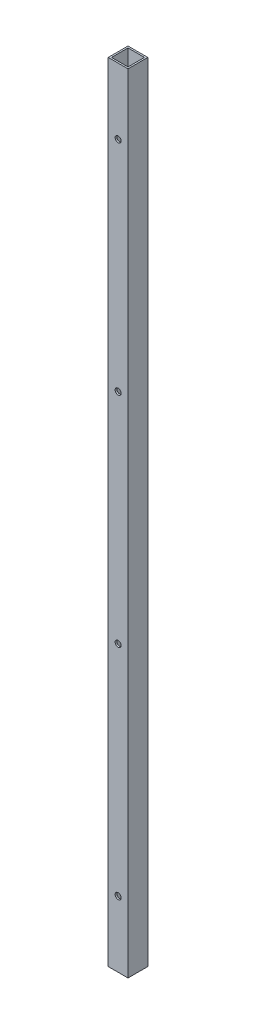
ISO-10303-21;
HEADER;
FILE_DESCRIPTION(('STEP AP214'),'2;1');
FILE_NAME('part.step','',(''),(''),'','','');
FILE_SCHEMA(('AUTOMOTIVE_DESIGN { 1 0 10303 214 1 1 1 1 }'));
ENDSEC;
DATA;
#1=APPLICATION_CONTEXT('core data for automotive mechanical design processes');
#2=APPLICATION_PROTOCOL_DEFINITION('international standard','automotive_design',2000,#1);
#3=PRODUCT_CONTEXT('',#1,'mechanical');
#4=PRODUCT('Part','Part','',(#3));
#5=PRODUCT_RELATED_PRODUCT_CATEGORY('part','',(#4));
#6=PRODUCT_DEFINITION_FORMATION('','',#4);
#7=PRODUCT_DEFINITION_CONTEXT('part definition',#1,'design');
#8=PRODUCT_DEFINITION('design','',#6,#7);
#9=PRODUCT_DEFINITION_SHAPE('','',#8);
#10=(LENGTH_UNIT() NAMED_UNIT(*) SI_UNIT(.MILLI.,.METRE.));
#11=(NAMED_UNIT(*) PLANE_ANGLE_UNIT() SI_UNIT($,.RADIAN.));
#12=(NAMED_UNIT(*) SI_UNIT($,.STERADIAN.) SOLID_ANGLE_UNIT());
#13=UNCERTAINTY_MEASURE_WITH_UNIT(LENGTH_MEASURE(1.E-05),#10,'distance_accuracy_value','');
#14=(GEOMETRIC_REPRESENTATION_CONTEXT(3) GLOBAL_UNCERTAINTY_ASSIGNED_CONTEXT((#13)) GLOBAL_UNIT_ASSIGNED_CONTEXT((#10,
#11,#12)) REPRESENTATION_CONTEXT('',''));
#15=CARTESIAN_POINT('',(0.,0.,0.));
#16=DIRECTION('',(0.,0.,1.));
#17=DIRECTION('',(1.,0.,0.));
#18=AXIS2_PLACEMENT_3D('',#15,#16,#17);
#19=CARTESIAN_POINT('',(0.,63.6015999999999,-9.525));
#20=DIRECTION('',(0.,0.,1.));
#21=DIRECTION('',(1.,0.,0.));
#22=AXIS2_PLACEMENT_3D('',#19,#20,#21);
#23=CYLINDRICAL_SURFACE('',#22,2.89559999999993);
#24=CARTESIAN_POINT('',(0.,63.6015999999999,7.93749999999999));
#25=DIRECTION('',(0.,0.,-1.));
#26=DIRECTION('',(-1.,0.,0.));
#27=AXIS2_PLACEMENT_3D('',#24,#25,#26);
#28=CIRCLE('',#27,2.89559999999993);
#29=CARTESIAN_POINT('',(-2.89559999999993,63.6015999999999,7.93749999999999));
#30=VERTEX_POINT('',#29);
#31=EDGE_CURVE('E39',#30,#30,#28,.T.);
#32=ORIENTED_EDGE('',*,*,#31,.T.);
#33=EDGE_LOOP('',(#32));
#34=FACE_BOUND('',#33,.T.);
#35=CARTESIAN_POINT('',(0.,63.6015999999999,9.525));
#36=DIRECTION('',(0.,0.,1.));
#37=DIRECTION('',(1.,0.,0.));
#38=AXIS2_PLACEMENT_3D('',#35,#36,#37);
#39=CIRCLE('',#38,2.89559999999993);
#40=CARTESIAN_POINT('',(2.89559999999993,63.6015999999999,9.525));
#41=VERTEX_POINT('',#40);
#42=EDGE_CURVE('E11',#41,#41,#39,.T.);
#43=ORIENTED_EDGE('',*,*,#42,.T.);
#44=EDGE_LOOP('',(#43));
#45=FACE_BOUND('',#44,.T.);
#46=ADVANCED_FACE('F32',(#34,#45),#23,.F.);
#47=CARTESIAN_POINT('',(0.,274.176066666667,-9.525));
#48=DIRECTION('',(0.,0.,1.));
#49=DIRECTION('',(1.,0.,0.));
#50=AXIS2_PLACEMENT_3D('',#47,#48,#49);
#51=CYLINDRICAL_SURFACE('',#50,2.89559999999993);
#52=CARTESIAN_POINT('',(0.,274.176066666667,7.93749999999999));
#53=DIRECTION('',(0.,0.,-1.));
#54=DIRECTION('',(-1.,0.,0.));
#55=AXIS2_PLACEMENT_3D('',#52,#53,#54);
#56=CIRCLE('',#55,2.89559999999993);
#57=CARTESIAN_POINT('',(-2.89559999999993,274.176066666667,7.93749999999999));
#58=VERTEX_POINT('',#57);
#59=EDGE_CURVE('E181',#58,#58,#56,.T.);
#60=ORIENTED_EDGE('',*,*,#59,.T.);
#61=EDGE_LOOP('',(#60));
#62=FACE_BOUND('',#61,.T.);
#63=CARTESIAN_POINT('',(0.,274.176066666667,9.525));
#64=DIRECTION('',(0.,0.,1.));
#65=DIRECTION('',(1.,0.,0.));
#66=AXIS2_PLACEMENT_3D('',#63,#64,#65);
#67=CIRCLE('',#66,2.89559999999993);
#68=CARTESIAN_POINT('',(2.89559999999993,274.176066666667,9.525));
#69=VERTEX_POINT('',#68);
#70=EDGE_CURVE('E184',#69,#69,#67,.T.);
#71=ORIENTED_EDGE('',*,*,#70,.T.);
#72=EDGE_LOOP('',(#71));
#73=FACE_BOUND('',#72,.T.);
#74=ADVANCED_FACE('F209',(#62,#73),#51,.F.);
#75=CARTESIAN_POINT('',(0.,63.6015999999999,-9.525));
#76=DIRECTION('',(0.,0.,1.));
#77=DIRECTION('',(1.,0.,0.));
#78=AXIS2_PLACEMENT_3D('',#75,#76,#77);
#79=CYLINDRICAL_SURFACE('',#78,2.89559999999993);
#80=CARTESIAN_POINT('',(0.,63.6015999999999,-7.9375));
#81=DIRECTION('',(0.,0.,1.));
#82=DIRECTION('',(1.,0.,0.));
#83=AXIS2_PLACEMENT_3D('',#80,#81,#82);
#84=CIRCLE('',#83,2.89559999999993);
#85=CARTESIAN_POINT('',(2.89559999999993,63.6015999999999,-7.9375));
#86=VERTEX_POINT('',#85);
#87=EDGE_CURVE('E175',#86,#86,#84,.T.);
#88=ORIENTED_EDGE('',*,*,#87,.T.);
#89=EDGE_LOOP('',(#88));
#90=FACE_BOUND('',#89,.T.);
#91=CARTESIAN_POINT('',(0.,63.6015999999999,-9.525));
#92=DIRECTION('',(0.,0.,1.));
#93=DIRECTION('',(1.,0.,0.));
#94=AXIS2_PLACEMENT_3D('',#91,#92,#93);
#95=CIRCLE('',#94,2.89559999999993);
#96=CARTESIAN_POINT('',(2.89559999999993,63.6015999999999,-9.525));
#97=VERTEX_POINT('',#96);
#98=EDGE_CURVE('E178',#97,#97,#95,.T.);
#99=ORIENTED_EDGE('',*,*,#98,.F.);
#100=EDGE_LOOP('',(#99));
#101=FACE_BOUND('',#100,.T.);
#102=ADVANCED_FACE('F213',(#90,#101),#79,.F.);
#103=CARTESIAN_POINT('',(0.,274.176066666667,-9.525));
#104=DIRECTION('',(0.,0.,1.));
#105=DIRECTION('',(1.,0.,0.));
#106=AXIS2_PLACEMENT_3D('',#103,#104,#105);
#107=CYLINDRICAL_SURFACE('',#106,2.89559999999993);
#108=CARTESIAN_POINT('',(0.,274.176066666667,-7.9375));
#109=DIRECTION('',(0.,0.,1.));
#110=DIRECTION('',(1.,0.,0.));
#111=AXIS2_PLACEMENT_3D('',#108,#109,#110);
#112=CIRCLE('',#111,2.89559999999993);
#113=CARTESIAN_POINT('',(2.89559999999993,274.176066666667,-7.9375));
#114=VERTEX_POINT('',#113);
#115=EDGE_CURVE('E165',#114,#114,#112,.T.);
#116=ORIENTED_EDGE('',*,*,#115,.T.);
#117=EDGE_LOOP('',(#116));
#118=FACE_BOUND('',#117,.T.);
#119=CARTESIAN_POINT('',(0.,274.176066666667,-9.525));
#120=DIRECTION('',(0.,0.,1.));
#121=DIRECTION('',(1.,0.,0.));
#122=AXIS2_PLACEMENT_3D('',#119,#120,#121);
#123=CIRCLE('',#122,2.89559999999993);
#124=CARTESIAN_POINT('',(2.89559999999993,274.176066666667,-9.525));
#125=VERTEX_POINT('',#124);
#126=EDGE_CURVE('E172',#125,#125,#123,.T.);
#127=ORIENTED_EDGE('',*,*,#126,.F.);
#128=EDGE_LOOP('',(#127));
#129=FACE_BOUND('',#128,.T.);
#130=ADVANCED_FACE('F218',(#118,#129),#107,.F.);
#131=CARTESIAN_POINT('',(0.,758.9266,0.));
#132=DIRECTION('',(0.,1.,0.));
#133=DIRECTION('',(0.,0.,1.));
#134=AXIS2_PLACEMENT_3D('',#131,#132,#133);
#135=PLANE('',#134);
#136=DIRECTION('',(0.,0.,-1.));
#137=VECTOR('',#136,1.);
#138=CARTESIAN_POINT('',(9.525,758.9266,-9.525));
#139=LINE('',#138,#137);
#140=CARTESIAN_POINT('',(9.525,758.9266,9.525));
#141=VERTEX_POINT('',#140);
#142=CARTESIAN_POINT('',(9.525,758.9266,-9.525));
#143=VERTEX_POINT('',#142);
#144=EDGE_CURVE('E136',#141,#143,#139,.T.);
#145=ORIENTED_EDGE('',*,*,#144,.T.);
#146=DIRECTION('',(-1.,0.,0.));
#147=VECTOR('',#146,1.);
#148=CARTESIAN_POINT('',(-9.525,758.9266,-9.525));
#149=LINE('',#148,#147);
#150=CARTESIAN_POINT('',(-9.525,758.9266,-9.525));
#151=VERTEX_POINT('',#150);
#152=EDGE_CURVE('E139',#143,#151,#149,.T.);
#153=ORIENTED_EDGE('',*,*,#152,.T.);
#154=DIRECTION('',(0.,0.,1.));
#155=VECTOR('',#154,1.);
#156=CARTESIAN_POINT('',(-9.525,758.9266,-9.525));
#157=LINE('',#156,#155);
#158=CARTESIAN_POINT('',(-9.525,758.9266,9.525));
#159=VERTEX_POINT('',#158);
#160=EDGE_CURVE('E142',#151,#159,#157,.T.);
#161=ORIENTED_EDGE('',*,*,#160,.T.);
#162=DIRECTION('',(1.,0.,0.));
#163=VECTOR('',#162,1.);
#164=CARTESIAN_POINT('',(-9.525,758.9266,9.525));
#165=LINE('',#164,#163);
#166=EDGE_CURVE('E144',#159,#141,#165,.T.);
#167=ORIENTED_EDGE('',*,*,#166,.T.);
#168=EDGE_LOOP('',(#145,#153,#161,#167));
#169=FACE_BOUND('',#168,.T.);
#170=DIRECTION('',(-1.,0.,0.));
#171=VECTOR('',#170,1.);
#172=CARTESIAN_POINT('',(-7.9375,758.9266,-7.9375));
#173=LINE('',#172,#171);
#174=CARTESIAN_POINT('',(7.9375,758.9266,-7.9375));
#175=VERTEX_POINT('',#174);
#176=CARTESIAN_POINT('',(-7.9375,758.9266,-7.9375));
#177=VERTEX_POINT('',#176);
#178=EDGE_CURVE('E104',#175,#177,#173,.T.);
#179=ORIENTED_EDGE('',*,*,#178,.F.);
#180=DIRECTION('',(0.,0.,-1.));
#181=VECTOR('',#180,1.);
#182=CARTESIAN_POINT('',(7.9375,758.9266,-7.9375));
#183=LINE('',#182,#181);
#184=CARTESIAN_POINT('',(7.9375,758.9266,7.9375));
#185=VERTEX_POINT('',#184);
#186=EDGE_CURVE('E96',#185,#175,#183,.T.);
#187=ORIENTED_EDGE('',*,*,#186,.F.);
#188=DIRECTION('',(1.,0.,0.));
#189=VECTOR('',#188,1.);
#190=CARTESIAN_POINT('',(-7.9375,758.9266,7.9375));
#191=LINE('',#190,#189);
#192=CARTESIAN_POINT('',(-7.9375,758.9266,7.9375));
#193=VERTEX_POINT('',#192);
#194=EDGE_CURVE('E120',#193,#185,#191,.T.);
#195=ORIENTED_EDGE('',*,*,#194,.F.);
#196=DIRECTION('',(0.,0.,1.));
#197=VECTOR('',#196,1.);
#198=CARTESIAN_POINT('',(-7.9375,758.9266,-7.9375));
#199=LINE('',#198,#197);
#200=EDGE_CURVE('E118',#177,#193,#199,.T.);
#201=ORIENTED_EDGE('',*,*,#200,.F.);
#202=EDGE_LOOP('',(#179,#187,#195,#201));
#203=FACE_BOUND('',#202,.T.);
#204=ADVANCED_FACE('F117',(#169,#203),#135,.T.);
#205=CARTESIAN_POINT('',(0.,0.,0.));
#206=DIRECTION('',(0.,1.,0.));
#207=DIRECTION('',(0.,0.,1.));
#208=AXIS2_PLACEMENT_3D('',#205,#206,#207);
#209=PLANE('',#208);
#210=DIRECTION('',(0.,0.,-1.));
#211=VECTOR('',#210,1.);
#212=CARTESIAN_POINT('',(9.525,0.,-9.525));
#213=LINE('',#212,#211);
#214=CARTESIAN_POINT('',(9.525,0.,9.525));
#215=VERTEX_POINT('',#214);
#216=CARTESIAN_POINT('',(9.525,0.,-9.525));
#217=VERTEX_POINT('',#216);
#218=EDGE_CURVE('E113',#215,#217,#213,.T.);
#219=ORIENTED_EDGE('',*,*,#218,.F.);
#220=DIRECTION('',(1.,0.,0.));
#221=VECTOR('',#220,1.);
#222=CARTESIAN_POINT('',(-9.525,0.,9.525));
#223=LINE('',#222,#221);
#224=CARTESIAN_POINT('',(-9.525,0.,9.525));
#225=VERTEX_POINT('',#224);
#226=EDGE_CURVE('E140',#225,#215,#223,.T.);
#227=ORIENTED_EDGE('',*,*,#226,.F.);
#228=DIRECTION('',(0.,0.,1.));
#229=VECTOR('',#228,1.);
#230=CARTESIAN_POINT('',(-9.525,0.,-9.525));
#231=LINE('',#230,#229);
#232=CARTESIAN_POINT('',(-9.525,0.,-9.525));
#233=VERTEX_POINT('',#232);
#234=EDGE_CURVE('E151',#233,#225,#231,.T.);
#235=ORIENTED_EDGE('',*,*,#234,.F.);
#236=DIRECTION('',(-1.,0.,0.));
#237=VECTOR('',#236,1.);
#238=CARTESIAN_POINT('',(-9.525,0.,-9.525));
#239=LINE('',#238,#237);
#240=EDGE_CURVE('E149',#217,#233,#239,.T.);
#241=ORIENTED_EDGE('',*,*,#240,.F.);
#242=EDGE_LOOP('',(#219,#227,#235,#241));
#243=FACE_BOUND('',#242,.T.);
#244=DIRECTION('',(0.,0.,-1.));
#245=VECTOR('',#244,1.);
#246=CARTESIAN_POINT('',(7.9375,0.,-7.9375));
#247=LINE('',#246,#245);
#248=CARTESIAN_POINT('',(7.9375,0.,7.9375));
#249=VERTEX_POINT('',#248);
#250=CARTESIAN_POINT('',(7.9375,0.,-7.9375));
#251=VERTEX_POINT('',#250);
#252=EDGE_CURVE('E54',#249,#251,#247,.T.);
#253=ORIENTED_EDGE('',*,*,#252,.T.);
#254=DIRECTION('',(-1.,0.,0.));
#255=VECTOR('',#254,1.);
#256=CARTESIAN_POINT('',(-7.9375,0.,-7.9375));
#257=LINE('',#256,#255);
#258=CARTESIAN_POINT('',(-7.9375,0.,-7.9375));
#259=VERTEX_POINT('',#258);
#260=EDGE_CURVE('E112',#251,#259,#257,.T.);
#261=ORIENTED_EDGE('',*,*,#260,.T.);
#262=DIRECTION('',(0.,0.,1.));
#263=VECTOR('',#262,1.);
#264=CARTESIAN_POINT('',(-7.9375,0.,-7.9375));
#265=LINE('',#264,#263);
#266=CARTESIAN_POINT('',(-7.9375,0.,7.9375));
#267=VERTEX_POINT('',#266);
#268=EDGE_CURVE('E128',#259,#267,#265,.T.);
#269=ORIENTED_EDGE('',*,*,#268,.T.);
#270=DIRECTION('',(1.,0.,0.));
#271=VECTOR('',#270,1.);
#272=CARTESIAN_POINT('',(-7.9375,0.,7.9375));
#273=LINE('',#272,#271);
#274=EDGE_CURVE('E105',#267,#249,#273,.T.);
#275=ORIENTED_EDGE('',*,*,#274,.T.);
#276=EDGE_LOOP('',(#253,#261,#269,#275));
#277=FACE_BOUND('',#276,.T.);
#278=ADVANCED_FACE('F230',(#243,#277),#209,.F.);
#279=CARTESIAN_POINT('',(9.525,758.9266,-9.525));
#280=DIRECTION('',(-1.,0.,0.));
#281=DIRECTION('',(0.,0.,1.));
#282=AXIS2_PLACEMENT_3D('',#279,#280,#281);
#283=PLANE('',#282);
#284=ORIENTED_EDGE('',*,*,#218,.T.);
#285=DIRECTION('',(0.,-1.,0.));
#286=VECTOR('',#285,1.);
#287=CARTESIAN_POINT('',(9.525,758.9266,-9.525));
#288=LINE('',#287,#286);
#289=EDGE_CURVE('E162',#143,#217,#288,.T.);
#290=ORIENTED_EDGE('',*,*,#289,.F.);
#291=ORIENTED_EDGE('',*,*,#144,.F.);
#292=DIRECTION('',(0.,-1.,0.));
#293=VECTOR('',#292,1.);
#294=CARTESIAN_POINT('',(9.525,758.9266,9.525));
#295=LINE('',#294,#293);
#296=EDGE_CURVE('E146',#141,#215,#295,.T.);
#297=ORIENTED_EDGE('',*,*,#296,.T.);
#298=EDGE_LOOP('',(#284,#290,#291,#297));
#299=FACE_BOUND('',#298,.T.);
#300=ADVANCED_FACE('F226',(#299),#283,.F.);
#301=CARTESIAN_POINT('',(-9.525,758.9266,-9.525));
#302=DIRECTION('',(0.,0.,1.));
#303=DIRECTION('',(1.,0.,0.));
#304=AXIS2_PLACEMENT_3D('',#301,#302,#303);
#305=PLANE('',#304);
#306=CARTESIAN_POINT('',(0.,484.750533333333,-9.525));
#307=DIRECTION('',(0.,0.,1.));
#308=DIRECTION('',(1.,0.,0.));
#309=AXIS2_PLACEMENT_3D('',#306,#307,#308);
#310=CIRCLE('',#309,2.89559999999993);
#311=CARTESIAN_POINT('',(2.89559999999993,484.750533333333,-9.525));
#312=VERTEX_POINT('',#311);
#313=EDGE_CURVE('E266',#312,#312,#310,.T.);
#314=ORIENTED_EDGE('',*,*,#313,.T.);
#315=EDGE_LOOP('',(#314));
#316=FACE_BOUND('',#315,.T.);
#317=CARTESIAN_POINT('',(0.,695.325,-9.525));
#318=DIRECTION('',(0.,0.,1.));
#319=DIRECTION('',(1.,0.,0.));
#320=AXIS2_PLACEMENT_3D('',#317,#318,#319);
#321=CIRCLE('',#320,2.89559999999993);
#322=CARTESIAN_POINT('',(2.89559999999993,695.325,-9.525));
#323=VERTEX_POINT('',#322);
#324=EDGE_CURVE('E169',#323,#323,#321,.T.);
#325=ORIENTED_EDGE('',*,*,#324,.T.);
#326=EDGE_LOOP('',(#325));
#327=FACE_BOUND('',#326,.T.);
#328=ORIENTED_EDGE('',*,*,#240,.T.);
#329=DIRECTION('',(0.,-1.,0.));
#330=VECTOR('',#329,1.);
#331=CARTESIAN_POINT('',(-9.525,758.9266,-9.525));
#332=LINE('',#331,#330);
#333=EDGE_CURVE('E159',#151,#233,#332,.T.);
#334=ORIENTED_EDGE('',*,*,#333,.F.);
#335=ORIENTED_EDGE('',*,*,#152,.F.);
#336=ORIENTED_EDGE('',*,*,#289,.T.);
#337=EDGE_LOOP('',(#328,#334,#335,#336));
#338=FACE_BOUND('',#337,.T.);
#339=ORIENTED_EDGE('',*,*,#126,.T.);
#340=EDGE_LOOP('',(#339));
#341=FACE_BOUND('',#340,.T.);
#342=ORIENTED_EDGE('',*,*,#98,.T.);
#343=EDGE_LOOP('',(#342));
#344=FACE_BOUND('',#343,.T.);
#345=ADVANCED_FACE('F229',(#316,#327,#338,#341,#344),#305,.F.);
#346=CARTESIAN_POINT('',(-9.525,758.9266,-9.525));
#347=DIRECTION('',(1.,0.,0.));
#348=DIRECTION('',(0.,0.,-1.));
#349=AXIS2_PLACEMENT_3D('',#346,#347,#348);
#350=PLANE('',#349);
#351=CARTESIAN_POINT('',(-9.525,84.5566,0.));
#352=DIRECTION('',(1.,0.,0.));
#353=DIRECTION('',(0.,0.,-1.));
#354=AXIS2_PLACEMENT_3D('',#351,#352,#353);
#355=CIRCLE('',#354,4.7625);
#356=CARTESIAN_POINT('',(-9.525,84.5566,-4.7625));
#357=VERTEX_POINT('',#356);
#358=EDGE_CURVE('E284',#357,#357,#355,.F.);
#359=ORIENTED_EDGE('',*,*,#358,.F.);
#360=EDGE_LOOP('',(#359));
#361=FACE_BOUND('',#360,.T.);
#362=CARTESIAN_POINT('',(-9.525,674.37,0.));
#363=DIRECTION('',(1.,0.,0.));
#364=DIRECTION('',(0.,0.,-1.));
#365=AXIS2_PLACEMENT_3D('',#362,#363,#364);
#366=CIRCLE('',#365,4.76250000000002);
#367=CARTESIAN_POINT('',(-9.525,674.37,-4.76250000000001));
#368=VERTEX_POINT('',#367);
#369=EDGE_CURVE('E278',#368,#368,#366,.F.);
#370=ORIENTED_EDGE('',*,*,#369,.F.);
#371=EDGE_LOOP('',(#370));
#372=FACE_BOUND('',#371,.T.);
#373=ORIENTED_EDGE('',*,*,#234,.T.);
#374=DIRECTION('',(0.,-1.,0.));
#375=VECTOR('',#374,1.);
#376=CARTESIAN_POINT('',(-9.525,758.9266,9.525));
#377=LINE('',#376,#375);
#378=EDGE_CURVE('E156',#159,#225,#377,.T.);
#379=ORIENTED_EDGE('',*,*,#378,.F.);
#380=ORIENTED_EDGE('',*,*,#160,.F.);
#381=ORIENTED_EDGE('',*,*,#333,.T.);
#382=EDGE_LOOP('',(#373,#379,#380,#381));
#383=FACE_BOUND('',#382,.T.);
#384=ADVANCED_FACE('F234',(#361,#372,#383),#350,.F.);
#385=CARTESIAN_POINT('',(-9.525,758.9266,9.525));
#386=DIRECTION('',(0.,0.,-1.));
#387=DIRECTION('',(-1.,0.,0.));
#388=AXIS2_PLACEMENT_3D('',#385,#386,#387);
#389=PLANE('',#388);
#390=CARTESIAN_POINT('',(0.,484.750533333333,9.525));
#391=DIRECTION('',(0.,0.,1.));
#392=DIRECTION('',(1.,0.,0.));
#393=AXIS2_PLACEMENT_3D('',#390,#391,#392);
#394=CIRCLE('',#393,2.89559999999993);
#395=CARTESIAN_POINT('',(2.89559999999993,484.750533333333,9.525));
#396=VERTEX_POINT('',#395);
#397=EDGE_CURVE('E272',#396,#396,#394,.T.);
#398=ORIENTED_EDGE('',*,*,#397,.F.);
#399=EDGE_LOOP('',(#398));
#400=FACE_BOUND('',#399,.T.);
#401=CARTESIAN_POINT('',(0.,695.325,9.525));
#402=DIRECTION('',(0.,0.,1.));
#403=DIRECTION('',(1.,0.,0.));
#404=AXIS2_PLACEMENT_3D('',#401,#402,#403);
#405=CIRCLE('',#404,2.89559999999993);
#406=CARTESIAN_POINT('',(2.89559999999993,695.325,9.525));
#407=VERTEX_POINT('',#406);
#408=EDGE_CURVE('E263',#407,#407,#405,.T.);
#409=ORIENTED_EDGE('',*,*,#408,.F.);
#410=EDGE_LOOP('',(#409));
#411=FACE_BOUND('',#410,.T.);
#412=ORIENTED_EDGE('',*,*,#226,.T.);
#413=ORIENTED_EDGE('',*,*,#296,.F.);
#414=ORIENTED_EDGE('',*,*,#166,.F.);
#415=ORIENTED_EDGE('',*,*,#378,.T.);
#416=EDGE_LOOP('',(#412,#413,#414,#415));
#417=FACE_BOUND('',#416,.T.);
#418=ORIENTED_EDGE('',*,*,#70,.F.);
#419=EDGE_LOOP('',(#418));
#420=FACE_BOUND('',#419,.T.);
#421=ORIENTED_EDGE('',*,*,#42,.F.);
#422=EDGE_LOOP('',(#421));
#423=FACE_BOUND('',#422,.T.);
#424=ADVANCED_FACE('F238',(#400,#411,#417,#420,#423),#389,.F.);
#425=CARTESIAN_POINT('',(7.9375,758.9266,-7.9375));
#426=DIRECTION('',(-1.,0.,0.));
#427=DIRECTION('',(0.,0.,1.));
#428=AXIS2_PLACEMENT_3D('',#425,#426,#427);
#429=PLANE('',#428);
#430=ORIENTED_EDGE('',*,*,#252,.F.);
#431=DIRECTION('',(0.,-1.,0.));
#432=VECTOR('',#431,1.);
#433=CARTESIAN_POINT('',(7.9375,758.9266,7.9375));
#434=LINE('',#433,#432);
#435=EDGE_CURVE('E100',#185,#249,#434,.T.);
#436=ORIENTED_EDGE('',*,*,#435,.F.);
#437=ORIENTED_EDGE('',*,*,#186,.T.);
#438=DIRECTION('',(0.,-1.,0.));
#439=VECTOR('',#438,1.);
#440=CARTESIAN_POINT('',(7.9375,758.9266,-7.9375));
#441=LINE('',#440,#439);
#442=EDGE_CURVE('E99',#175,#251,#441,.T.);
#443=ORIENTED_EDGE('',*,*,#442,.T.);
#444=EDGE_LOOP('',(#430,#436,#437,#443));
#445=FACE_BOUND('',#444,.T.);
#446=ADVANCED_FACE('F98',(#445),#429,.T.);
#447=CARTESIAN_POINT('',(-7.9375,758.9266,-7.9375));
#448=DIRECTION('',(0.,0.,1.));
#449=DIRECTION('',(1.,0.,0.));
#450=AXIS2_PLACEMENT_3D('',#447,#448,#449);
#451=PLANE('',#450);
#452=CARTESIAN_POINT('',(0.,484.750533333333,-7.9375));
#453=DIRECTION('',(0.,0.,1.));
#454=DIRECTION('',(1.,0.,0.));
#455=AXIS2_PLACEMENT_3D('',#452,#453,#454);
#456=CIRCLE('',#455,2.89559999999993);
#457=CARTESIAN_POINT('',(2.89559999999993,484.750533333333,-7.9375));
#458=VERTEX_POINT('',#457);
#459=EDGE_CURVE('E258',#458,#458,#456,.T.);
#460=ORIENTED_EDGE('',*,*,#459,.F.);
#461=EDGE_LOOP('',(#460));
#462=FACE_BOUND('',#461,.T.);
#463=CARTESIAN_POINT('',(0.,695.325,-7.9375));
#464=DIRECTION('',(0.,0.,1.));
#465=DIRECTION('',(1.,0.,0.));
#466=AXIS2_PLACEMENT_3D('',#463,#464,#465);
#467=CIRCLE('',#466,2.89559999999993);
#468=CARTESIAN_POINT('',(2.89559999999993,695.325,-7.9375));
#469=VERTEX_POINT('',#468);
#470=EDGE_CURVE('E126',#469,#469,#467,.T.);
#471=ORIENTED_EDGE('',*,*,#470,.F.);
#472=EDGE_LOOP('',(#471));
#473=FACE_BOUND('',#472,.T.);
#474=ORIENTED_EDGE('',*,*,#260,.F.);
#475=ORIENTED_EDGE('',*,*,#442,.F.);
#476=ORIENTED_EDGE('',*,*,#178,.T.);
#477=DIRECTION('',(0.,-1.,0.));
#478=VECTOR('',#477,1.);
#479=CARTESIAN_POINT('',(-7.9375,758.9266,-7.9375));
#480=LINE('',#479,#478);
#481=EDGE_CURVE('E114',#177,#259,#480,.T.);
#482=ORIENTED_EDGE('',*,*,#481,.T.);
#483=EDGE_LOOP('',(#474,#475,#476,#482));
#484=FACE_BOUND('',#483,.T.);
#485=ORIENTED_EDGE('',*,*,#115,.F.);
#486=EDGE_LOOP('',(#485));
#487=FACE_BOUND('',#486,.T.);
#488=ORIENTED_EDGE('',*,*,#87,.F.);
#489=EDGE_LOOP('',(#488));
#490=FACE_BOUND('',#489,.T.);
#491=ADVANCED_FACE('F108',(#462,#473,#484,#487,#490),#451,.T.);
#492=CARTESIAN_POINT('',(-7.9375,758.9266,-7.9375));
#493=DIRECTION('',(1.,0.,0.));
#494=DIRECTION('',(0.,0.,-1.));
#495=AXIS2_PLACEMENT_3D('',#492,#493,#494);
#496=PLANE('',#495);
#497=CARTESIAN_POINT('',(-7.9375,84.5566,0.));
#498=DIRECTION('',(1.,0.,0.));
#499=DIRECTION('',(0.,0.,-1.));
#500=AXIS2_PLACEMENT_3D('',#497,#498,#499);
#501=CIRCLE('',#500,4.7625);
#502=CARTESIAN_POINT('',(-7.9375,84.5566,-4.7625));
#503=VERTEX_POINT('',#502);
#504=EDGE_CURVE('E287',#503,#503,#501,.F.);
#505=ORIENTED_EDGE('',*,*,#504,.T.);
#506=EDGE_LOOP('',(#505));
#507=FACE_BOUND('',#506,.T.);
#508=CARTESIAN_POINT('',(-7.9375,674.37,0.));
#509=DIRECTION('',(1.,0.,0.));
#510=DIRECTION('',(0.,0.,-1.));
#511=AXIS2_PLACEMENT_3D('',#508,#509,#510);
#512=CIRCLE('',#511,4.76250000000002);
#513=CARTESIAN_POINT('',(-7.9375,674.37,-4.76250000000001));
#514=VERTEX_POINT('',#513);
#515=EDGE_CURVE('E281',#514,#514,#512,.F.);
#516=ORIENTED_EDGE('',*,*,#515,.T.);
#517=EDGE_LOOP('',(#516));
#518=FACE_BOUND('',#517,.T.);
#519=ORIENTED_EDGE('',*,*,#268,.F.);
#520=ORIENTED_EDGE('',*,*,#481,.F.);
#521=ORIENTED_EDGE('',*,*,#200,.T.);
#522=DIRECTION('',(0.,-1.,0.));
#523=VECTOR('',#522,1.);
#524=CARTESIAN_POINT('',(-7.9375,758.9266,7.9375));
#525=LINE('',#524,#523);
#526=EDGE_CURVE('E46',#193,#267,#525,.T.);
#527=ORIENTED_EDGE('',*,*,#526,.T.);
#528=EDGE_LOOP('',(#519,#520,#521,#527));
#529=FACE_BOUND('',#528,.T.);
#530=ADVANCED_FACE('F194',(#507,#518,#529),#496,.T.);
#531=CARTESIAN_POINT('',(-7.9375,758.9266,7.9375));
#532=DIRECTION('',(0.,0.,-1.));
#533=DIRECTION('',(-1.,0.,0.));
#534=AXIS2_PLACEMENT_3D('',#531,#532,#533);
#535=PLANE('',#534);
#536=CARTESIAN_POINT('',(0.,484.750533333333,7.93749999999999));
#537=DIRECTION('',(0.,0.,-1.));
#538=DIRECTION('',(-1.,0.,0.));
#539=AXIS2_PLACEMENT_3D('',#536,#537,#538);
#540=CIRCLE('',#539,2.89559999999993);
#541=CARTESIAN_POINT('',(-2.89559999999993,484.750533333333,7.93749999999999));
#542=VERTEX_POINT('',#541);
#543=EDGE_CURVE('E275',#542,#542,#540,.T.);
#544=ORIENTED_EDGE('',*,*,#543,.F.);
#545=EDGE_LOOP('',(#544));
#546=FACE_BOUND('',#545,.T.);
#547=CARTESIAN_POINT('',(0.,695.325,7.93749999999999));
#548=DIRECTION('',(0.,0.,-1.));
#549=DIRECTION('',(-1.,0.,0.));
#550=AXIS2_PLACEMENT_3D('',#547,#548,#549);
#551=CIRCLE('',#550,2.89559999999993);
#552=CARTESIAN_POINT('',(-2.89559999999993,695.325,7.93749999999999));
#553=VERTEX_POINT('',#552);
#554=EDGE_CURVE('E166',#553,#553,#551,.T.);
#555=ORIENTED_EDGE('',*,*,#554,.F.);
#556=EDGE_LOOP('',(#555));
#557=FACE_BOUND('',#556,.T.);
#558=ORIENTED_EDGE('',*,*,#274,.F.);
#559=ORIENTED_EDGE('',*,*,#526,.F.);
#560=ORIENTED_EDGE('',*,*,#194,.T.);
#561=ORIENTED_EDGE('',*,*,#435,.T.);
#562=EDGE_LOOP('',(#558,#559,#560,#561));
#563=FACE_BOUND('',#562,.T.);
#564=ORIENTED_EDGE('',*,*,#59,.F.);
#565=EDGE_LOOP('',(#564));
#566=FACE_BOUND('',#565,.T.);
#567=ORIENTED_EDGE('',*,*,#31,.F.);
#568=EDGE_LOOP('',(#567));
#569=FACE_BOUND('',#568,.T.);
#570=ADVANCED_FACE('F191',(#546,#557,#563,#566,#569),#535,.T.);
#571=CARTESIAN_POINT('',(0.,695.325,-9.525));
#572=DIRECTION('',(0.,0.,1.));
#573=DIRECTION('',(1.,0.,0.));
#574=AXIS2_PLACEMENT_3D('',#571,#572,#573);
#575=CYLINDRICAL_SURFACE('',#574,2.89559999999993);
#576=ORIENTED_EDGE('',*,*,#554,.T.);
#577=EDGE_LOOP('',(#576));
#578=FACE_BOUND('',#577,.T.);
#579=ORIENTED_EDGE('',*,*,#408,.T.);
#580=EDGE_LOOP('',(#579));
#581=FACE_BOUND('',#580,.T.);
#582=ADVANCED_FACE('F193',(#578,#581),#575,.F.);
#583=ORIENTED_EDGE('',*,*,#470,.T.);
#584=EDGE_LOOP('',(#583));
#585=FACE_BOUND('',#584,.T.);
#586=ORIENTED_EDGE('',*,*,#324,.F.);
#587=EDGE_LOOP('',(#586));
#588=FACE_BOUND('',#587,.T.);
#589=ADVANCED_FACE('F201',(#585,#588),#575,.F.);
#590=CARTESIAN_POINT('',(0.,484.750533333333,-9.525));
#591=DIRECTION('',(0.,0.,1.));
#592=DIRECTION('',(1.,0.,0.));
#593=AXIS2_PLACEMENT_3D('',#590,#591,#592);
#594=CYLINDRICAL_SURFACE('',#593,2.89559999999993);
#595=ORIENTED_EDGE('',*,*,#459,.T.);
#596=EDGE_LOOP('',(#595));
#597=FACE_BOUND('',#596,.T.);
#598=ORIENTED_EDGE('',*,*,#313,.F.);
#599=EDGE_LOOP('',(#598));
#600=FACE_BOUND('',#599,.T.);
#601=ADVANCED_FACE('F336',(#597,#600),#594,.F.);
#602=CARTESIAN_POINT('',(0.,484.750533333333,-9.525));
#603=DIRECTION('',(0.,0.,1.));
#604=DIRECTION('',(1.,0.,0.));
#605=AXIS2_PLACEMENT_3D('',#602,#603,#604);
#606=CYLINDRICAL_SURFACE('',#605,2.89559999999993);
#607=ORIENTED_EDGE('',*,*,#543,.T.);
#608=EDGE_LOOP('',(#607));
#609=FACE_BOUND('',#608,.T.);
#610=ORIENTED_EDGE('',*,*,#397,.T.);
#611=EDGE_LOOP('',(#610));
#612=FACE_BOUND('',#611,.T.);
#613=ADVANCED_FACE('F330',(#609,#612),#606,.F.);
#614=CARTESIAN_POINT('',(-9.525012,674.37,0.));
#615=DIRECTION('',(1.,0.,0.));
#616=DIRECTION('',(0.,0.,-1.));
#617=AXIS2_PLACEMENT_3D('',#614,#615,#616);
#618=CYLINDRICAL_SURFACE('',#617,4.76250000000002);
#619=ORIENTED_EDGE('',*,*,#515,.F.);
#620=EDGE_LOOP('',(#619));
#621=FACE_BOUND('',#620,.T.);
#622=ORIENTED_EDGE('',*,*,#369,.T.);
#623=EDGE_LOOP('',(#622));
#624=FACE_BOUND('',#623,.T.);
#625=ADVANCED_FACE('F295',(#621,#624),#618,.F.);
#626=CARTESIAN_POINT('',(-9.525012,84.5566,0.));
#627=DIRECTION('',(1.,0.,0.));
#628=DIRECTION('',(0.,0.,-1.));
#629=AXIS2_PLACEMENT_3D('',#626,#627,#628);
#630=CYLINDRICAL_SURFACE('',#629,4.7625);
#631=ORIENTED_EDGE('',*,*,#504,.F.);
#632=EDGE_LOOP('',(#631));
#633=FACE_BOUND('',#632,.T.);
#634=ORIENTED_EDGE('',*,*,#358,.T.);
#635=EDGE_LOOP('',(#634));
#636=FACE_BOUND('',#635,.T.);
#637=ADVANCED_FACE('F292',(#633,#636),#630,.F.);
#638=CLOSED_SHELL('',(#46,#74,#102,#130,#204,#278,#300,#345,#384,#424,#446,#491,#530,#570,#582,
#589,#601,#613,#625,#637));
#639=MANIFOLD_SOLID_BREP('B2',#638);
#640=ADVANCED_BREP_SHAPE_REPRESENTATION('',(#18,#639),#14);
#641=SHAPE_DEFINITION_REPRESENTATION(#9,#640);
ENDSEC;
END-ISO-10303-21;
